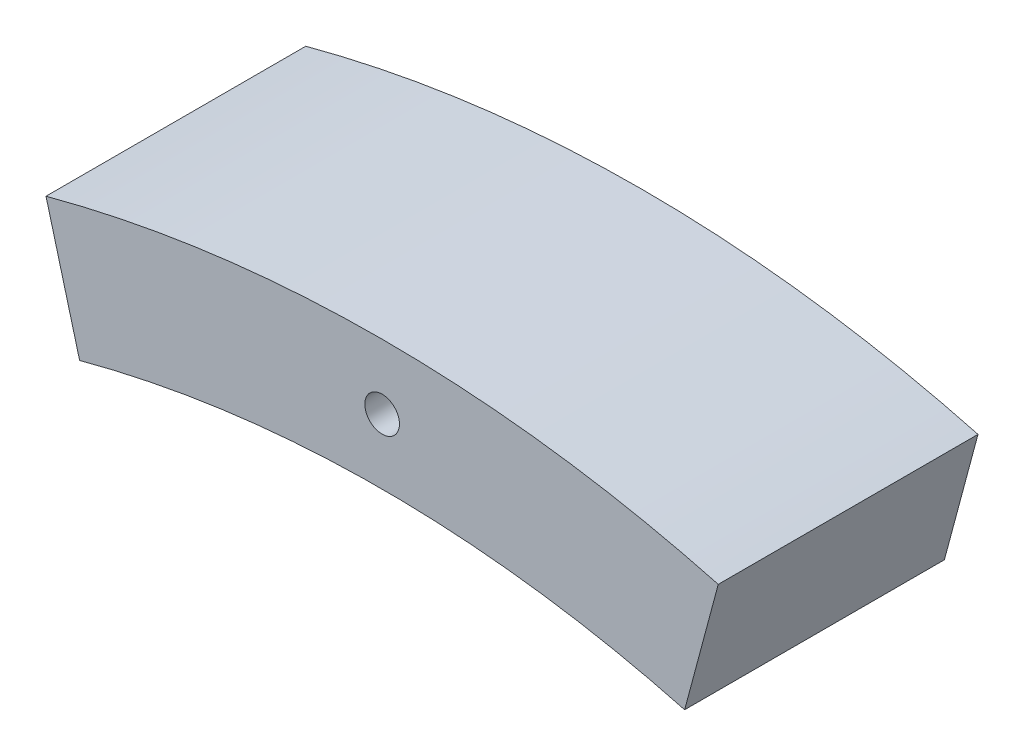
ISO-10303-21;
HEADER;
FILE_DESCRIPTION(('STEP AP214'),'2;1');
FILE_NAME('part.step','',(''),(''),'','','');
FILE_SCHEMA(('AUTOMOTIVE_DESIGN { 1 0 10303 214 1 1 1 1 }'));
ENDSEC;
DATA;
#1=APPLICATION_CONTEXT('core data for automotive mechanical design processes');
#2=APPLICATION_PROTOCOL_DEFINITION('international standard','automotive_design',2000,#1);
#3=PRODUCT_CONTEXT('',#1,'mechanical');
#4=PRODUCT('Part','Part','',(#3));
#5=PRODUCT_RELATED_PRODUCT_CATEGORY('part','',(#4));
#6=PRODUCT_DEFINITION_FORMATION('','',#4);
#7=PRODUCT_DEFINITION_CONTEXT('part definition',#1,'design');
#8=PRODUCT_DEFINITION('design','',#6,#7);
#9=PRODUCT_DEFINITION_SHAPE('','',#8);
#10=(LENGTH_UNIT() NAMED_UNIT(*) SI_UNIT(.MILLI.,.METRE.));
#11=(NAMED_UNIT(*) PLANE_ANGLE_UNIT() SI_UNIT($,.RADIAN.));
#12=(NAMED_UNIT(*) SI_UNIT($,.STERADIAN.) SOLID_ANGLE_UNIT());
#13=UNCERTAINTY_MEASURE_WITH_UNIT(LENGTH_MEASURE(1.E-05),#10,'distance_accuracy_value','');
#14=(GEOMETRIC_REPRESENTATION_CONTEXT(3) GLOBAL_UNCERTAINTY_ASSIGNED_CONTEXT((#13)) GLOBAL_UNIT_ASSIGNED_CONTEXT((#10,
#11,#12)) REPRESENTATION_CONTEXT('',''));
#15=CARTESIAN_POINT('',(0.,0.,0.));
#16=DIRECTION('',(0.,0.,1.));
#17=DIRECTION('',(1.,0.,0.));
#18=AXIS2_PLACEMENT_3D('',#15,#16,#17);
#19=CARTESIAN_POINT('',(0.,0.,-15.));
#20=DIRECTION('',(0.,0.,1.));
#21=DIRECTION('',(1.,0.,0.));
#22=AXIS2_PLACEMENT_3D('',#19,#20,#21);
#23=CYLINDRICAL_SURFACE('',#22,150.);
#24=DIRECTION('',(0.,0.,1.));
#25=VECTOR('',#24,1.);
#26=CARTESIAN_POINT('',(-38.8228567653782,144.88887394336,-15.));
#27=LINE('',#26,#25);
#28=CARTESIAN_POINT('',(-38.8228567653782,144.88887394336,-15.));
#29=VERTEX_POINT('',#28);
#30=CARTESIAN_POINT('',(-38.8228567653782,144.88887394336,15.));
#31=VERTEX_POINT('',#30);
#32=EDGE_CURVE('E36',#29,#31,#27,.T.);
#33=ORIENTED_EDGE('',*,*,#32,.T.);
#34=CARTESIAN_POINT('',(0.,0.,15.));
#35=DIRECTION('',(0.,0.,1.));
#36=DIRECTION('',(-1.,0.,0.));
#37=AXIS2_PLACEMENT_3D('',#34,#35,#36);
#38=CIRCLE('',#37,150.);
#39=CARTESIAN_POINT('',(38.8228567653782,144.88887394336,15.));
#40=VERTEX_POINT('',#39);
#41=EDGE_CURVE('E73',#40,#31,#38,.T.);
#42=ORIENTED_EDGE('',*,*,#41,.F.);
#43=DIRECTION('',(0.,0.,1.));
#44=VECTOR('',#43,1.);
#45=CARTESIAN_POINT('',(38.8228567653782,144.88887394336,-15.));
#46=LINE('',#45,#44);
#47=CARTESIAN_POINT('',(38.8228567653782,144.88887394336,-15.));
#48=VERTEX_POINT('',#47);
#49=EDGE_CURVE('E11',#48,#40,#46,.T.);
#50=ORIENTED_EDGE('',*,*,#49,.F.);
#51=CARTESIAN_POINT('',(0.,0.,-15.));
#52=DIRECTION('',(0.,0.,1.));
#53=DIRECTION('',(-1.,0.,0.));
#54=AXIS2_PLACEMENT_3D('',#51,#52,#53);
#55=CIRCLE('',#54,150.);
#56=EDGE_CURVE('E74',#48,#29,#55,.T.);
#57=ORIENTED_EDGE('',*,*,#56,.T.);
#58=EDGE_LOOP('',(#33,#42,#50,#57));
#59=FACE_BOUND('',#58,.T.);
#60=ADVANCED_FACE('F33',(#59),#23,.T.);
#61=CARTESIAN_POINT('',(34.9405710888404,130.399986549024,-15.));
#62=DIRECTION('',(0.965925826289068,-0.25881904510252,0.));
#63=DIRECTION('',(0.25881904510252,0.965925826289068,0.));
#64=AXIS2_PLACEMENT_3D('',#61,#62,#63);
#65=PLANE('',#64);
#66=ORIENTED_EDGE('',*,*,#49,.T.);
#67=DIRECTION('',(0.258819045102521,0.965925826289069,0.));
#68=VECTOR('',#67,1.);
#69=CARTESIAN_POINT('',(34.9405710888404,130.399986549024,15.));
#70=LINE('',#69,#68);
#71=CARTESIAN_POINT('',(34.9405710888404,130.399986549024,15.));
#72=VERTEX_POINT('',#71);
#73=EDGE_CURVE('E91',#72,#40,#70,.T.);
#74=ORIENTED_EDGE('',*,*,#73,.F.);
#75=DIRECTION('',(0.,0.,1.));
#76=VECTOR('',#75,1.);
#77=CARTESIAN_POINT('',(34.9405710888404,130.399986549024,-15.));
#78=LINE('',#77,#76);
#79=CARTESIAN_POINT('',(34.9405710888404,130.399986549024,-15.));
#80=VERTEX_POINT('',#79);
#81=EDGE_CURVE('E41',#80,#72,#78,.T.);
#82=ORIENTED_EDGE('',*,*,#81,.F.);
#83=DIRECTION('',(0.258819045102521,0.965925826289069,0.));
#84=VECTOR('',#83,1.);
#85=CARTESIAN_POINT('',(34.9405710888404,130.399986549024,-15.));
#86=LINE('',#85,#84);
#87=EDGE_CURVE('E79',#80,#48,#86,.T.);
#88=ORIENTED_EDGE('',*,*,#87,.T.);
#89=EDGE_LOOP('',(#66,#74,#82,#88));
#90=FACE_BOUND('',#89,.T.);
#91=ADVANCED_FACE('F112',(#90),#65,.T.);
#92=CARTESIAN_POINT('',(0.,0.,-15.));
#93=DIRECTION('',(0.,0.,1.));
#94=DIRECTION('',(1.,0.,0.));
#95=AXIS2_PLACEMENT_3D('',#92,#93,#94);
#96=CYLINDRICAL_SURFACE('',#95,135.);
#97=ORIENTED_EDGE('',*,*,#81,.T.);
#98=CARTESIAN_POINT('',(0.,0.,15.));
#99=DIRECTION('',(0.,0.,-1.));
#100=DIRECTION('',(-1.,0.,0.));
#101=AXIS2_PLACEMENT_3D('',#98,#99,#100);
#102=CIRCLE('',#101,135.);
#103=CARTESIAN_POINT('',(-34.9405710888404,130.399986549024,15.));
#104=VERTEX_POINT('',#103);
#105=EDGE_CURVE('E86',#104,#72,#102,.T.);
#106=ORIENTED_EDGE('',*,*,#105,.F.);
#107=DIRECTION('',(0.,0.,1.));
#108=VECTOR('',#107,1.);
#109=CARTESIAN_POINT('',(-34.9405710888404,130.399986549024,-15.));
#110=LINE('',#109,#108);
#111=CARTESIAN_POINT('',(-34.9405710888404,130.399986549024,-15.));
#112=VERTEX_POINT('',#111);
#113=EDGE_CURVE('E78',#112,#104,#110,.T.);
#114=ORIENTED_EDGE('',*,*,#113,.F.);
#115=CARTESIAN_POINT('',(0.,0.,-15.));
#116=DIRECTION('',(0.,0.,-1.));
#117=DIRECTION('',(-1.,0.,0.));
#118=AXIS2_PLACEMENT_3D('',#115,#116,#117);
#119=CIRCLE('',#118,135.);
#120=EDGE_CURVE('E105',#112,#80,#119,.T.);
#121=ORIENTED_EDGE('',*,*,#120,.T.);
#122=EDGE_LOOP('',(#97,#106,#114,#121));
#123=FACE_BOUND('',#122,.T.);
#124=ADVANCED_FACE('F109',(#123),#96,.F.);
#125=CARTESIAN_POINT('',(-34.9405710888404,130.399986549024,-15.));
#126=DIRECTION('',(-0.965925826289068,-0.258819045102521,0.));
#127=DIRECTION('',(0.258819045102521,-0.965925826289068,0.));
#128=AXIS2_PLACEMENT_3D('',#125,#126,#127);
#129=PLANE('',#128);
#130=ORIENTED_EDGE('',*,*,#113,.T.);
#131=DIRECTION('',(0.258819045102521,-0.965925826289068,0.));
#132=VECTOR('',#131,1.);
#133=CARTESIAN_POINT('',(-34.9405710888404,130.399986549024,15.));
#134=LINE('',#133,#132);
#135=EDGE_CURVE('E81',#31,#104,#134,.T.);
#136=ORIENTED_EDGE('',*,*,#135,.F.);
#137=ORIENTED_EDGE('',*,*,#32,.F.);
#138=DIRECTION('',(0.258819045102521,-0.965925826289068,0.));
#139=VECTOR('',#138,1.);
#140=CARTESIAN_POINT('',(-34.9405710888404,130.399986549024,-15.));
#141=LINE('',#140,#139);
#142=EDGE_CURVE('E103',#29,#112,#141,.T.);
#143=ORIENTED_EDGE('',*,*,#142,.T.);
#144=EDGE_LOOP('',(#130,#136,#137,#143));
#145=FACE_BOUND('',#144,.T.);
#146=ADVANCED_FACE('F82',(#145),#129,.T.);
#147=CARTESIAN_POINT('',(0.,0.,-15.));
#148=DIRECTION('',(0.,0.,-1.));
#149=DIRECTION('',(-1.,0.,0.));
#150=AXIS2_PLACEMENT_3D('',#147,#148,#149);
#151=PLANE('',#150);
#152=CARTESIAN_POINT('',(0.,142.5,-15.));
#153=DIRECTION('',(0.,0.,1.));
#154=DIRECTION('',(1.,0.,0.));
#155=AXIS2_PLACEMENT_3D('',#152,#153,#154);
#156=CIRCLE('',#155,2.);
#157=CARTESIAN_POINT('',(2.,142.5,-15.));
#158=VERTEX_POINT('',#157);
#159=EDGE_CURVE('E99',#158,#158,#156,.T.);
#160=ORIENTED_EDGE('',*,*,#159,.T.);
#161=EDGE_LOOP('',(#160));
#162=FACE_BOUND('',#161,.T.);
#163=ORIENTED_EDGE('',*,*,#56,.F.);
#164=ORIENTED_EDGE('',*,*,#87,.F.);
#165=ORIENTED_EDGE('',*,*,#120,.F.);
#166=ORIENTED_EDGE('',*,*,#142,.F.);
#167=EDGE_LOOP('',(#163,#164,#165,#166));
#168=FACE_BOUND('',#167,.T.);
#169=ADVANCED_FACE('F114',(#162,#168),#151,.T.);
#170=CARTESIAN_POINT('',(0.,142.5,-15.));
#171=DIRECTION('',(0.,0.,1.));
#172=DIRECTION('',(1.,0.,0.));
#173=AXIS2_PLACEMENT_3D('',#170,#171,#172);
#174=CYLINDRICAL_SURFACE('',#173,2.);
#175=ORIENTED_EDGE('',*,*,#159,.F.);
#176=EDGE_LOOP('',(#175));
#177=FACE_BOUND('',#176,.T.);
#178=CARTESIAN_POINT('',(0.,142.5,15.));
#179=DIRECTION('',(0.,0.,1.));
#180=DIRECTION('',(1.,0.,0.));
#181=AXIS2_PLACEMENT_3D('',#178,#179,#180);
#182=CIRCLE('',#181,2.);
#183=CARTESIAN_POINT('',(2.,142.5,15.));
#184=VERTEX_POINT('',#183);
#185=EDGE_CURVE('E92',#184,#184,#182,.T.);
#186=ORIENTED_EDGE('',*,*,#185,.T.);
#187=EDGE_LOOP('',(#186));
#188=FACE_BOUND('',#187,.T.);
#189=ADVANCED_FACE('F116',(#177,#188),#174,.F.);
#190=CARTESIAN_POINT('',(0.,0.,15.));
#191=DIRECTION('',(0.,0.,-1.));
#192=DIRECTION('',(-1.,0.,0.));
#193=AXIS2_PLACEMENT_3D('',#190,#191,#192);
#194=PLANE('',#193);
#195=ORIENTED_EDGE('',*,*,#41,.T.);
#196=ORIENTED_EDGE('',*,*,#135,.T.);
#197=ORIENTED_EDGE('',*,*,#105,.T.);
#198=ORIENTED_EDGE('',*,*,#73,.T.);
#199=EDGE_LOOP('',(#195,#196,#197,#198));
#200=FACE_BOUND('',#199,.T.);
#201=ORIENTED_EDGE('',*,*,#185,.F.);
#202=EDGE_LOOP('',(#201));
#203=FACE_BOUND('',#202,.T.);
#204=ADVANCED_FACE('F89',(#200,#203),#194,.F.);
#205=CLOSED_SHELL('',(#60,#91,#124,#146,#169,#189,#204));
#206=MANIFOLD_SOLID_BREP('B2',#205);
#207=ADVANCED_BREP_SHAPE_REPRESENTATION('',(#18,#206),#14);
#208=SHAPE_DEFINITION_REPRESENTATION(#9,#207);
ENDSEC;
END-ISO-10303-21;
